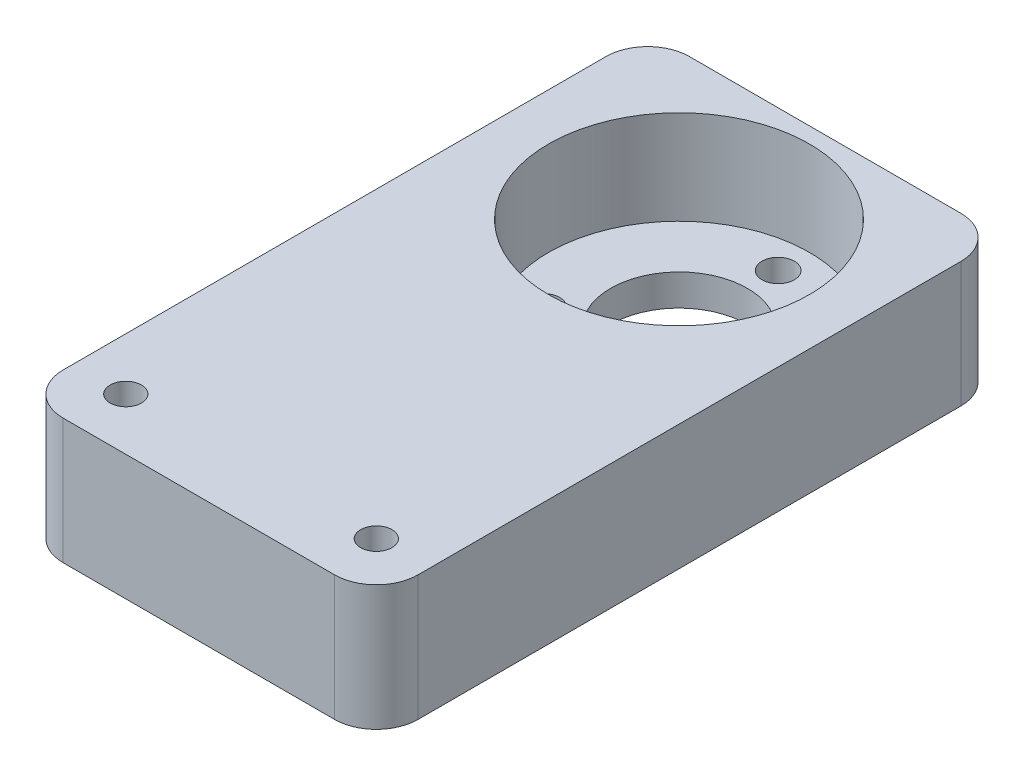
ISO-10303-21;
HEADER;
FILE_DESCRIPTION(('STEP AP214'),'2;1');
FILE_NAME('part.step','',(''),(''),'','','');
FILE_SCHEMA(('AUTOMOTIVE_DESIGN { 1 0 10303 214 1 1 1 1 }'));
ENDSEC;
DATA;
#1=APPLICATION_CONTEXT('core data for automotive mechanical design processes');
#2=APPLICATION_PROTOCOL_DEFINITION('international standard','automotive_design',2000,#1);
#3=PRODUCT_CONTEXT('',#1,'mechanical');
#4=PRODUCT('Part','Part','',(#3));
#5=PRODUCT_RELATED_PRODUCT_CATEGORY('part','',(#4));
#6=PRODUCT_DEFINITION_FORMATION('','',#4);
#7=PRODUCT_DEFINITION_CONTEXT('part definition',#1,'design');
#8=PRODUCT_DEFINITION('design','',#6,#7);
#9=PRODUCT_DEFINITION_SHAPE('','',#8);
#10=(LENGTH_UNIT() NAMED_UNIT(*) SI_UNIT(.MILLI.,.METRE.));
#11=(NAMED_UNIT(*) PLANE_ANGLE_UNIT() SI_UNIT($,.RADIAN.));
#12=(NAMED_UNIT(*) SI_UNIT($,.STERADIAN.) SOLID_ANGLE_UNIT());
#13=UNCERTAINTY_MEASURE_WITH_UNIT(LENGTH_MEASURE(1.E-05),#10,'distance_accuracy_value','');
#14=(GEOMETRIC_REPRESENTATION_CONTEXT(3) GLOBAL_UNCERTAINTY_ASSIGNED_CONTEXT((#13)) GLOBAL_UNIT_ASSIGNED_CONTEXT((#10,
#11,#12)) REPRESENTATION_CONTEXT('',''));
#15=CARTESIAN_POINT('',(0.,0.,0.));
#16=DIRECTION('',(0.,0.,1.));
#17=DIRECTION('',(1.,0.,0.));
#18=AXIS2_PLACEMENT_3D('',#15,#16,#17);
#19=CARTESIAN_POINT('',(17.,12.,30.));
#20=DIRECTION('',(-1.,0.,0.));
#21=DIRECTION('',(0.,0.,1.));
#22=AXIS2_PLACEMENT_3D('',#19,#20,#21);
#23=PLANE('',#22);
#24=DIRECTION('',(0.,0.,-1.));
#25=VECTOR('',#24,1.);
#26=CARTESIAN_POINT('',(17.,12.,30.));
#27=LINE('',#26,#25);
#28=CARTESIAN_POINT('',(17.,12.,26.));
#29=VERTEX_POINT('',#28);
#30=CARTESIAN_POINT('',(17.,12.,-26.));
#31=VERTEX_POINT('',#30);
#32=EDGE_CURVE('E121',#29,#31,#27,.T.);
#33=ORIENTED_EDGE('',*,*,#32,.F.);
#34=DIRECTION('',(0.,-1.,0.));
#35=VECTOR('',#34,1.);
#36=CARTESIAN_POINT('',(17.,12.,26.));
#37=LINE('',#36,#35);
#38=CARTESIAN_POINT('',(17.,0.,26.));
#39=VERTEX_POINT('',#38);
#40=EDGE_CURVE('E106',#29,#39,#37,.T.);
#41=ORIENTED_EDGE('',*,*,#40,.T.);
#42=DIRECTION('',(0.,0.,-1.));
#43=VECTOR('',#42,1.);
#44=CARTESIAN_POINT('',(17.,0.,30.));
#45=LINE('',#44,#43);
#46=CARTESIAN_POINT('',(17.,0.,-26.));
#47=VERTEX_POINT('',#46);
#48=EDGE_CURVE('E118',#39,#47,#45,.T.);
#49=ORIENTED_EDGE('',*,*,#48,.T.);
#50=DIRECTION('',(0.,-1.,0.));
#51=VECTOR('',#50,1.);
#52=CARTESIAN_POINT('',(17.,12.,-26.));
#53=LINE('',#52,#51);
#54=EDGE_CURVE('E123',#47,#31,#53,.F.);
#55=ORIENTED_EDGE('',*,*,#54,.T.);
#56=EDGE_LOOP('',(#33,#41,#49,#55));
#57=FACE_BOUND('',#56,.T.);
#58=ADVANCED_FACE('F35',(#57),#23,.F.);
#59=CARTESIAN_POINT('',(-17.,12.,-30.));
#60=DIRECTION('',(0.,0.,1.));
#61=DIRECTION('',(1.,0.,0.));
#62=AXIS2_PLACEMENT_3D('',#59,#60,#61);
#63=PLANE('',#62);
#64=DIRECTION('',(-1.,0.,0.));
#65=VECTOR('',#64,1.);
#66=CARTESIAN_POINT('',(-17.,12.,-30.));
#67=LINE('',#66,#65);
#68=CARTESIAN_POINT('',(13.,12.,-30.));
#69=VERTEX_POINT('',#68);
#70=CARTESIAN_POINT('',(-13.,12.,-30.));
#71=VERTEX_POINT('',#70);
#72=EDGE_CURVE('E166',#69,#71,#67,.T.);
#73=ORIENTED_EDGE('',*,*,#72,.F.);
#74=DIRECTION('',(0.,-1.,0.));
#75=VECTOR('',#74,1.);
#76=CARTESIAN_POINT('',(13.,12.,-30.));
#77=LINE('',#76,#75);
#78=CARTESIAN_POINT('',(13.,0.,-30.));
#79=VERTEX_POINT('',#78);
#80=EDGE_CURVE('E11',#69,#79,#77,.T.);
#81=ORIENTED_EDGE('',*,*,#80,.T.);
#82=DIRECTION('',(-1.,0.,0.));
#83=VECTOR('',#82,1.);
#84=CARTESIAN_POINT('',(-17.,0.,-30.));
#85=LINE('',#84,#83);
#86=CARTESIAN_POINT('',(-13.,0.,-30.));
#87=VERTEX_POINT('',#86);
#88=EDGE_CURVE('E129',#79,#87,#85,.T.);
#89=ORIENTED_EDGE('',*,*,#88,.T.);
#90=DIRECTION('',(0.,-1.,0.));
#91=VECTOR('',#90,1.);
#92=CARTESIAN_POINT('',(-13.,12.,-30.));
#93=LINE('',#92,#91);
#94=EDGE_CURVE('E43',#87,#71,#93,.F.);
#95=ORIENTED_EDGE('',*,*,#94,.T.);
#96=EDGE_LOOP('',(#73,#81,#89,#95));
#97=FACE_BOUND('',#96,.T.);
#98=ADVANCED_FACE('F165',(#97),#63,.F.);
#99=CARTESIAN_POINT('',(-17.,12.,30.));
#100=DIRECTION('',(1.,0.,0.));
#101=DIRECTION('',(0.,0.,-1.));
#102=AXIS2_PLACEMENT_3D('',#99,#100,#101);
#103=PLANE('',#102);
#104=DIRECTION('',(0.,0.,1.));
#105=VECTOR('',#104,1.);
#106=CARTESIAN_POINT('',(-17.,0.,30.));
#107=LINE('',#106,#105);
#108=CARTESIAN_POINT('',(-17.,0.,-26.));
#109=VERTEX_POINT('',#108);
#110=CARTESIAN_POINT('',(-17.,0.,26.));
#111=VERTEX_POINT('',#110);
#112=EDGE_CURVE('E133',#109,#111,#107,.T.);
#113=ORIENTED_EDGE('',*,*,#112,.T.);
#114=DIRECTION('',(0.,-1.,0.));
#115=VECTOR('',#114,1.);
#116=CARTESIAN_POINT('',(-17.,12.,26.));
#117=LINE('',#116,#115);
#118=CARTESIAN_POINT('',(-17.,12.,26.));
#119=VERTEX_POINT('',#118);
#120=EDGE_CURVE('E50',#111,#119,#117,.F.);
#121=ORIENTED_EDGE('',*,*,#120,.T.);
#122=DIRECTION('',(0.,0.,1.));
#123=VECTOR('',#122,1.);
#124=CARTESIAN_POINT('',(-17.,12.,30.));
#125=LINE('',#124,#123);
#126=CARTESIAN_POINT('',(-17.,12.,-26.));
#127=VERTEX_POINT('',#126);
#128=EDGE_CURVE('E173',#127,#119,#125,.T.);
#129=ORIENTED_EDGE('',*,*,#128,.F.);
#130=DIRECTION('',(0.,-1.,0.));
#131=VECTOR('',#130,1.);
#132=CARTESIAN_POINT('',(-17.,12.,-26.));
#133=LINE('',#132,#131);
#134=EDGE_CURVE('E159',#127,#109,#133,.T.);
#135=ORIENTED_EDGE('',*,*,#134,.T.);
#136=EDGE_LOOP('',(#113,#121,#129,#135));
#137=FACE_BOUND('',#136,.T.);
#138=ADVANCED_FACE('F177',(#137),#103,.F.);
#139=CARTESIAN_POINT('',(-17.,12.,30.));
#140=DIRECTION('',(0.,0.,-1.));
#141=DIRECTION('',(-1.,0.,0.));
#142=AXIS2_PLACEMENT_3D('',#139,#140,#141);
#143=PLANE('',#142);
#144=DIRECTION('',(1.,0.,0.));
#145=VECTOR('',#144,1.);
#146=CARTESIAN_POINT('',(-17.,0.,30.));
#147=LINE('',#146,#145);
#148=CARTESIAN_POINT('',(-13.,0.,30.));
#149=VERTEX_POINT('',#148);
#150=CARTESIAN_POINT('',(13.,0.,30.));
#151=VERTEX_POINT('',#150);
#152=EDGE_CURVE('E143',#149,#151,#147,.T.);
#153=ORIENTED_EDGE('',*,*,#152,.T.);
#154=DIRECTION('',(0.,-1.,0.));
#155=VECTOR('',#154,1.);
#156=CARTESIAN_POINT('',(13.,12.,30.));
#157=LINE('',#156,#155);
#158=CARTESIAN_POINT('',(13.,12.,30.));
#159=VERTEX_POINT('',#158);
#160=EDGE_CURVE('E107',#151,#159,#157,.F.);
#161=ORIENTED_EDGE('',*,*,#160,.T.);
#162=DIRECTION('',(1.,0.,0.));
#163=VECTOR('',#162,1.);
#164=CARTESIAN_POINT('',(-17.,12.,30.));
#165=LINE('',#164,#163);
#166=CARTESIAN_POINT('',(-13.,12.,30.));
#167=VERTEX_POINT('',#166);
#168=EDGE_CURVE('E139',#167,#159,#165,.T.);
#169=ORIENTED_EDGE('',*,*,#168,.F.);
#170=DIRECTION('',(0.,-1.,0.));
#171=VECTOR('',#170,1.);
#172=CARTESIAN_POINT('',(-13.,12.,30.));
#173=LINE('',#172,#171);
#174=EDGE_CURVE('E112',#167,#149,#173,.T.);
#175=ORIENTED_EDGE('',*,*,#174,.T.);
#176=EDGE_LOOP('',(#153,#161,#169,#175));
#177=FACE_BOUND('',#176,.T.);
#178=ADVANCED_FACE('F184',(#177),#143,.F.);
#179=CARTESIAN_POINT('',(0.,12.,0.));
#180=DIRECTION('',(0.,-1.,0.));
#181=DIRECTION('',(0.,0.,-1.));
#182=AXIS2_PLACEMENT_3D('',#179,#180,#181);
#183=PLANE('',#182);
#184=CARTESIAN_POINT('',(0.,12.,-16.));
#185=DIRECTION('',(0.,1.,0.));
#186=DIRECTION('',(0.,0.,1.));
#187=AXIS2_PLACEMENT_3D('',#184,#185,#186);
#188=CIRCLE('',#187,12.5);
#189=CARTESIAN_POINT('',(0.,12.,-3.5));
#190=VERTEX_POINT('',#189);
#191=EDGE_CURVE('E136',#190,#190,#188,.T.);
#192=ORIENTED_EDGE('',*,*,#191,.F.);
#193=EDGE_LOOP('',(#192));
#194=FACE_BOUND('',#193,.T.);
#195=ORIENTED_EDGE('',*,*,#168,.T.);
#196=CARTESIAN_POINT('',(13.,12.,26.));
#197=DIRECTION('',(0.,-1.,0.));
#198=DIRECTION('',(0.,0.,-1.));
#199=AXIS2_PLACEMENT_3D('',#196,#197,#198);
#200=CIRCLE('',#199,4.);
#201=EDGE_CURVE('E157',#159,#29,#200,.F.);
#202=ORIENTED_EDGE('',*,*,#201,.T.);
#203=ORIENTED_EDGE('',*,*,#32,.T.);
#204=CARTESIAN_POINT('',(13.,12.,-26.));
#205=DIRECTION('',(0.,-1.,0.));
#206=DIRECTION('',(0.,0.,-1.));
#207=AXIS2_PLACEMENT_3D('',#204,#205,#206);
#208=CIRCLE('',#207,4.);
#209=EDGE_CURVE('E153',#31,#69,#208,.F.);
#210=ORIENTED_EDGE('',*,*,#209,.T.);
#211=ORIENTED_EDGE('',*,*,#72,.T.);
#212=CARTESIAN_POINT('',(-13.,12.,-26.));
#213=DIRECTION('',(0.,-1.,0.));
#214=DIRECTION('',(0.,0.,-1.));
#215=AXIS2_PLACEMENT_3D('',#212,#213,#214);
#216=CIRCLE('',#215,4.);
#217=EDGE_CURVE('E57',#71,#127,#216,.F.);
#218=ORIENTED_EDGE('',*,*,#217,.T.);
#219=ORIENTED_EDGE('',*,*,#128,.T.);
#220=CARTESIAN_POINT('',(-13.,12.,26.));
#221=DIRECTION('',(0.,-1.,0.));
#222=DIRECTION('',(0.,0.,-1.));
#223=AXIS2_PLACEMENT_3D('',#220,#221,#222);
#224=CIRCLE('',#223,4.);
#225=EDGE_CURVE('E155',#119,#167,#224,.F.);
#226=ORIENTED_EDGE('',*,*,#225,.T.);
#227=EDGE_LOOP('',(#195,#202,#203,#210,#211,#218,#219,#226));
#228=FACE_BOUND('',#227,.T.);
#229=CARTESIAN_POINT('',(-12.,12.,25.));
#230=DIRECTION('',(0.,1.,0.));
#231=DIRECTION('',(0.,0.,1.));
#232=AXIS2_PLACEMENT_3D('',#229,#230,#231);
#233=CIRCLE('',#232,1.5);
#234=CARTESIAN_POINT('',(-12.,12.,26.5));
#235=VERTEX_POINT('',#234);
#236=EDGE_CURVE('E216',#235,#235,#233,.T.);
#237=ORIENTED_EDGE('',*,*,#236,.F.);
#238=EDGE_LOOP('',(#237));
#239=FACE_BOUND('',#238,.T.);
#240=CARTESIAN_POINT('',(12.,12.,25.));
#241=DIRECTION('',(0.,1.,0.));
#242=DIRECTION('',(0.,0.,1.));
#243=AXIS2_PLACEMENT_3D('',#240,#241,#242);
#244=CIRCLE('',#243,1.5);
#245=CARTESIAN_POINT('',(12.,12.,26.5));
#246=VERTEX_POINT('',#245);
#247=EDGE_CURVE('E222',#246,#246,#244,.T.);
#248=ORIENTED_EDGE('',*,*,#247,.F.);
#249=EDGE_LOOP('',(#248));
#250=FACE_BOUND('',#249,.T.);
#251=ADVANCED_FACE('F170',(#194,#228,#239,#250),#183,.F.);
#252=CARTESIAN_POINT('',(0.,0.,0.));
#253=DIRECTION('',(0.,-1.,0.));
#254=DIRECTION('',(0.,0.,-1.));
#255=AXIS2_PLACEMENT_3D('',#252,#253,#254);
#256=PLANE('',#255);
#257=CARTESIAN_POINT('',(0.,0.,-25.5));
#258=DIRECTION('',(0.,1.,0.));
#259=DIRECTION('',(0.,0.,1.));
#260=AXIS2_PLACEMENT_3D('',#257,#258,#259);
#261=CIRCLE('',#260,1.55);
#262=CARTESIAN_POINT('',(0.,0.,-23.95));
#263=VERTEX_POINT('',#262);
#264=EDGE_CURVE('E193',#263,#263,#261,.T.);
#265=ORIENTED_EDGE('',*,*,#264,.T.);
#266=EDGE_LOOP('',(#265));
#267=FACE_BOUND('',#266,.T.);
#268=CARTESIAN_POINT('',(8.22724133595217,0.,-11.25));
#269=DIRECTION('',(0.,1.,0.));
#270=DIRECTION('',(0.,0.,1.));
#271=AXIS2_PLACEMENT_3D('',#268,#269,#270);
#272=CIRCLE('',#271,1.54999999999973);
#273=CARTESIAN_POINT('',(8.22724133595217,0.,-9.70000000000027));
#274=VERTEX_POINT('',#273);
#275=EDGE_CURVE('E206',#274,#274,#272,.T.);
#276=ORIENTED_EDGE('',*,*,#275,.T.);
#277=EDGE_LOOP('',(#276));
#278=FACE_BOUND('',#277,.T.);
#279=CARTESIAN_POINT('',(-8.22724133595217,0.,-11.25));
#280=DIRECTION('',(0.,1.,0.));
#281=DIRECTION('',(0.,0.,1.));
#282=AXIS2_PLACEMENT_3D('',#279,#280,#281);
#283=CIRCLE('',#282,1.54999999999963);
#284=CARTESIAN_POINT('',(-8.22724133595217,0.,-9.70000000000036));
#285=VERTEX_POINT('',#284);
#286=EDGE_CURVE('E199',#285,#285,#283,.T.);
#287=ORIENTED_EDGE('',*,*,#286,.T.);
#288=EDGE_LOOP('',(#287));
#289=FACE_BOUND('',#288,.T.);
#290=CARTESIAN_POINT('',(0.,0.,-16.));
#291=DIRECTION('',(0.,1.,0.));
#292=DIRECTION('',(0.,0.,1.));
#293=AXIS2_PLACEMENT_3D('',#290,#291,#292);
#294=CIRCLE('',#293,6.55);
#295=CARTESIAN_POINT('',(0.,0.,-9.45));
#296=VERTEX_POINT('',#295);
#297=EDGE_CURVE('E188',#296,#296,#294,.T.);
#298=ORIENTED_EDGE('',*,*,#297,.T.);
#299=EDGE_LOOP('',(#298));
#300=FACE_BOUND('',#299,.T.);
#301=ORIENTED_EDGE('',*,*,#48,.F.);
#302=CARTESIAN_POINT('',(13.,0.,26.));
#303=DIRECTION('',(0.,-1.,0.));
#304=DIRECTION('',(0.,0.,-1.));
#305=AXIS2_PLACEMENT_3D('',#302,#303,#304);
#306=CIRCLE('',#305,4.);
#307=EDGE_CURVE('E102',#39,#151,#306,.T.);
#308=ORIENTED_EDGE('',*,*,#307,.T.);
#309=ORIENTED_EDGE('',*,*,#152,.F.);
#310=CARTESIAN_POINT('',(-13.,0.,26.));
#311=DIRECTION('',(0.,-1.,0.));
#312=DIRECTION('',(0.,0.,-1.));
#313=AXIS2_PLACEMENT_3D('',#310,#311,#312);
#314=CIRCLE('',#313,4.);
#315=EDGE_CURVE('E113',#149,#111,#314,.T.);
#316=ORIENTED_EDGE('',*,*,#315,.T.);
#317=ORIENTED_EDGE('',*,*,#112,.F.);
#318=CARTESIAN_POINT('',(-13.,0.,-26.));
#319=DIRECTION('',(0.,-1.,0.));
#320=DIRECTION('',(0.,0.,-1.));
#321=AXIS2_PLACEMENT_3D('',#318,#319,#320);
#322=CIRCLE('',#321,4.);
#323=EDGE_CURVE('E122',#109,#87,#322,.T.);
#324=ORIENTED_EDGE('',*,*,#323,.T.);
#325=ORIENTED_EDGE('',*,*,#88,.F.);
#326=CARTESIAN_POINT('',(13.,0.,-26.));
#327=DIRECTION('',(0.,-1.,0.));
#328=DIRECTION('',(0.,0.,-1.));
#329=AXIS2_PLACEMENT_3D('',#326,#327,#328);
#330=CIRCLE('',#329,4.);
#331=EDGE_CURVE('E128',#79,#47,#330,.T.);
#332=ORIENTED_EDGE('',*,*,#331,.T.);
#333=EDGE_LOOP('',(#301,#308,#309,#316,#317,#324,#325,#332));
#334=FACE_BOUND('',#333,.T.);
#335=CARTESIAN_POINT('',(-12.,0.,25.));
#336=DIRECTION('',(0.,-1.,0.));
#337=DIRECTION('',(0.,0.,-1.));
#338=AXIS2_PLACEMENT_3D('',#335,#336,#337);
#339=CIRCLE('',#338,1.5);
#340=CARTESIAN_POINT('',(-12.,0.,23.5));
#341=VERTEX_POINT('',#340);
#342=EDGE_CURVE('E200',#341,#341,#339,.F.);
#343=ORIENTED_EDGE('',*,*,#342,.T.);
#344=EDGE_LOOP('',(#343));
#345=FACE_BOUND('',#344,.T.);
#346=CARTESIAN_POINT('',(12.,0.,25.));
#347=DIRECTION('',(0.,-1.,0.));
#348=DIRECTION('',(0.,0.,-1.));
#349=AXIS2_PLACEMENT_3D('',#346,#347,#348);
#350=CIRCLE('',#349,1.5);
#351=CARTESIAN_POINT('',(12.,0.,23.5));
#352=VERTEX_POINT('',#351);
#353=EDGE_CURVE('E219',#352,#352,#350,.F.);
#354=ORIENTED_EDGE('',*,*,#353,.T.);
#355=EDGE_LOOP('',(#354));
#356=FACE_BOUND('',#355,.T.);
#357=ADVANCED_FACE('F125',(#267,#278,#289,#300,#334,#345,#356),#256,.T.);
#358=CARTESIAN_POINT('',(0.,3.,-16.));
#359=DIRECTION('',(0.,1.,0.));
#360=DIRECTION('',(0.,0.,1.));
#361=AXIS2_PLACEMENT_3D('',#358,#359,#360);
#362=CYLINDRICAL_SURFACE('',#361,12.5);
#363=CARTESIAN_POINT('',(0.,3.,-16.));
#364=DIRECTION('',(0.,1.,0.));
#365=DIRECTION('',(0.,0.,1.));
#366=AXIS2_PLACEMENT_3D('',#363,#364,#365);
#367=CIRCLE('',#366,12.5);
#368=CARTESIAN_POINT('',(0.,3.,-3.5));
#369=VERTEX_POINT('',#368);
#370=EDGE_CURVE('E130',#369,#369,#367,.T.);
#371=ORIENTED_EDGE('',*,*,#370,.F.);
#372=EDGE_LOOP('',(#371));
#373=FACE_BOUND('',#372,.T.);
#374=ORIENTED_EDGE('',*,*,#191,.T.);
#375=EDGE_LOOP('',(#374));
#376=FACE_BOUND('',#375,.T.);
#377=ADVANCED_FACE('F236',(#373,#376),#362,.F.);
#378=CARTESIAN_POINT('',(0.,3.,-16.));
#379=DIRECTION('',(0.,1.,0.));
#380=DIRECTION('',(0.,0.,1.));
#381=AXIS2_PLACEMENT_3D('',#378,#379,#380);
#382=PLANE('',#381);
#383=CARTESIAN_POINT('',(0.,3.,-25.5));
#384=DIRECTION('',(0.,1.,0.));
#385=DIRECTION('',(0.,0.,1.));
#386=AXIS2_PLACEMENT_3D('',#383,#384,#385);
#387=CIRCLE('',#386,1.55);
#388=CARTESIAN_POINT('',(0.,3.,-23.95));
#389=VERTEX_POINT('',#388);
#390=EDGE_CURVE('E209',#389,#389,#387,.T.);
#391=ORIENTED_EDGE('',*,*,#390,.F.);
#392=EDGE_LOOP('',(#391));
#393=FACE_BOUND('',#392,.T.);
#394=CARTESIAN_POINT('',(8.22724133595217,3.,-11.25));
#395=DIRECTION('',(0.,1.,0.));
#396=DIRECTION('',(0.,0.,1.));
#397=AXIS2_PLACEMENT_3D('',#394,#395,#396);
#398=CIRCLE('',#397,1.54999999999973);
#399=CARTESIAN_POINT('',(8.22724133595217,3.,-9.70000000000027));
#400=VERTEX_POINT('',#399);
#401=EDGE_CURVE('E203',#400,#400,#398,.T.);
#402=ORIENTED_EDGE('',*,*,#401,.F.);
#403=EDGE_LOOP('',(#402));
#404=FACE_BOUND('',#403,.T.);
#405=CARTESIAN_POINT('',(-8.22724133595217,3.,-11.25));
#406=DIRECTION('',(0.,1.,0.));
#407=DIRECTION('',(0.,0.,1.));
#408=AXIS2_PLACEMENT_3D('',#405,#406,#407);
#409=CIRCLE('',#408,1.54999999999963);
#410=CARTESIAN_POINT('',(-8.22724133595217,3.,-9.70000000000036));
#411=VERTEX_POINT('',#410);
#412=EDGE_CURVE('E196',#411,#411,#409,.T.);
#413=ORIENTED_EDGE('',*,*,#412,.F.);
#414=EDGE_LOOP('',(#413));
#415=FACE_BOUND('',#414,.T.);
#416=CARTESIAN_POINT('',(0.,3.,-16.));
#417=DIRECTION('',(0.,1.,0.));
#418=DIRECTION('',(0.,0.,1.));
#419=AXIS2_PLACEMENT_3D('',#416,#417,#418);
#420=CIRCLE('',#419,6.55);
#421=CARTESIAN_POINT('',(0.,3.,-9.45));
#422=VERTEX_POINT('',#421);
#423=EDGE_CURVE('E190',#422,#422,#420,.T.);
#424=ORIENTED_EDGE('',*,*,#423,.F.);
#425=EDGE_LOOP('',(#424));
#426=FACE_BOUND('',#425,.T.);
#427=ORIENTED_EDGE('',*,*,#370,.T.);
#428=EDGE_LOOP('',(#427));
#429=FACE_BOUND('',#428,.T.);
#430=ADVANCED_FACE('F286',(#393,#404,#415,#426,#429),#382,.T.);
#431=CARTESIAN_POINT('',(0.,0.,-16.));
#432=DIRECTION('',(0.,1.,0.));
#433=DIRECTION('',(0.,0.,1.));
#434=AXIS2_PLACEMENT_3D('',#431,#432,#433);
#435=CYLINDRICAL_SURFACE('',#434,6.55);
#436=ORIENTED_EDGE('',*,*,#297,.F.);
#437=EDGE_LOOP('',(#436));
#438=FACE_BOUND('',#437,.T.);
#439=ORIENTED_EDGE('',*,*,#423,.T.);
#440=EDGE_LOOP('',(#439));
#441=FACE_BOUND('',#440,.T.);
#442=ADVANCED_FACE('F282',(#438,#441),#435,.F.);
#443=CARTESIAN_POINT('',(-8.22724133595217,0.,-11.25));
#444=DIRECTION('',(0.,1.,0.));
#445=DIRECTION('',(0.,0.,1.));
#446=AXIS2_PLACEMENT_3D('',#443,#444,#445);
#447=CYLINDRICAL_SURFACE('',#446,1.54999999999963);
#448=ORIENTED_EDGE('',*,*,#286,.F.);
#449=EDGE_LOOP('',(#448));
#450=FACE_BOUND('',#449,.T.);
#451=ORIENTED_EDGE('',*,*,#412,.T.);
#452=EDGE_LOOP('',(#451));
#453=FACE_BOUND('',#452,.T.);
#454=ADVANCED_FACE('F278',(#450,#453),#447,.F.);
#455=CARTESIAN_POINT('',(8.22724133595217,0.,-11.25));
#456=DIRECTION('',(0.,1.,0.));
#457=DIRECTION('',(0.,0.,1.));
#458=AXIS2_PLACEMENT_3D('',#455,#456,#457);
#459=CYLINDRICAL_SURFACE('',#458,1.54999999999973);
#460=ORIENTED_EDGE('',*,*,#275,.F.);
#461=EDGE_LOOP('',(#460));
#462=FACE_BOUND('',#461,.T.);
#463=ORIENTED_EDGE('',*,*,#401,.T.);
#464=EDGE_LOOP('',(#463));
#465=FACE_BOUND('',#464,.T.);
#466=ADVANCED_FACE('F274',(#462,#465),#459,.F.);
#467=CARTESIAN_POINT('',(0.,0.,-25.5));
#468=DIRECTION('',(0.,1.,0.));
#469=DIRECTION('',(0.,0.,1.));
#470=AXIS2_PLACEMENT_3D('',#467,#468,#469);
#471=CYLINDRICAL_SURFACE('',#470,1.55);
#472=ORIENTED_EDGE('',*,*,#264,.F.);
#473=EDGE_LOOP('',(#472));
#474=FACE_BOUND('',#473,.T.);
#475=ORIENTED_EDGE('',*,*,#390,.T.);
#476=EDGE_LOOP('',(#475));
#477=FACE_BOUND('',#476,.T.);
#478=ADVANCED_FACE('F253',(#474,#477),#471,.F.);
#479=CARTESIAN_POINT('',(13.,12.,26.));
#480=DIRECTION('',(0.,-1.,0.));
#481=DIRECTION('',(0.,0.,-1.));
#482=AXIS2_PLACEMENT_3D('',#479,#480,#481);
#483=CYLINDRICAL_SURFACE('',#482,4.);
#484=ORIENTED_EDGE('',*,*,#201,.F.);
#485=ORIENTED_EDGE('',*,*,#160,.F.);
#486=ORIENTED_EDGE('',*,*,#307,.F.);
#487=ORIENTED_EDGE('',*,*,#40,.F.);
#488=EDGE_LOOP('',(#484,#485,#486,#487));
#489=FACE_BOUND('',#488,.T.);
#490=ADVANCED_FACE('F105',(#489),#483,.T.);
#491=CARTESIAN_POINT('',(-13.,12.,26.));
#492=DIRECTION('',(0.,-1.,0.));
#493=DIRECTION('',(0.,0.,-1.));
#494=AXIS2_PLACEMENT_3D('',#491,#492,#493);
#495=CYLINDRICAL_SURFACE('',#494,4.);
#496=ORIENTED_EDGE('',*,*,#225,.F.);
#497=ORIENTED_EDGE('',*,*,#120,.F.);
#498=ORIENTED_EDGE('',*,*,#315,.F.);
#499=ORIENTED_EDGE('',*,*,#174,.F.);
#500=EDGE_LOOP('',(#496,#497,#498,#499));
#501=FACE_BOUND('',#500,.T.);
#502=ADVANCED_FACE('F181',(#501),#495,.T.);
#503=CARTESIAN_POINT('',(13.,12.,-26.));
#504=DIRECTION('',(0.,-1.,0.));
#505=DIRECTION('',(0.,0.,-1.));
#506=AXIS2_PLACEMENT_3D('',#503,#504,#505);
#507=CYLINDRICAL_SURFACE('',#506,4.);
#508=ORIENTED_EDGE('',*,*,#209,.F.);
#509=ORIENTED_EDGE('',*,*,#54,.F.);
#510=ORIENTED_EDGE('',*,*,#331,.F.);
#511=ORIENTED_EDGE('',*,*,#80,.F.);
#512=EDGE_LOOP('',(#508,#509,#510,#511));
#513=FACE_BOUND('',#512,.T.);
#514=ADVANCED_FACE('F255',(#513),#507,.T.);
#515=CARTESIAN_POINT('',(-13.,12.,-26.));
#516=DIRECTION('',(0.,-1.,0.));
#517=DIRECTION('',(0.,0.,-1.));
#518=AXIS2_PLACEMENT_3D('',#515,#516,#517);
#519=CYLINDRICAL_SURFACE('',#518,4.);
#520=ORIENTED_EDGE('',*,*,#217,.F.);
#521=ORIENTED_EDGE('',*,*,#94,.F.);
#522=ORIENTED_EDGE('',*,*,#323,.F.);
#523=ORIENTED_EDGE('',*,*,#134,.F.);
#524=EDGE_LOOP('',(#520,#521,#522,#523));
#525=FACE_BOUND('',#524,.T.);
#526=ADVANCED_FACE('F37',(#525),#519,.T.);
#527=CARTESIAN_POINT('',(-12.,-5.939696961967,25.));
#528=DIRECTION('',(0.,1.,0.));
#529=DIRECTION('',(0.,0.,1.));
#530=AXIS2_PLACEMENT_3D('',#527,#528,#529);
#531=CYLINDRICAL_SURFACE('',#530,1.5);
#532=ORIENTED_EDGE('',*,*,#236,.T.);
#533=EDGE_LOOP('',(#532));
#534=FACE_BOUND('',#533,.T.);
#535=ORIENTED_EDGE('',*,*,#342,.F.);
#536=EDGE_LOOP('',(#535));
#537=FACE_BOUND('',#536,.T.);
#538=ADVANCED_FACE('F260',(#534,#537),#531,.F.);
#539=CARTESIAN_POINT('',(12.,-5.939696961967,25.));
#540=DIRECTION('',(0.,1.,0.));
#541=DIRECTION('',(0.,0.,1.));
#542=AXIS2_PLACEMENT_3D('',#539,#540,#541);
#543=CYLINDRICAL_SURFACE('',#542,1.5);
#544=ORIENTED_EDGE('',*,*,#247,.T.);
#545=EDGE_LOOP('',(#544));
#546=FACE_BOUND('',#545,.T.);
#547=ORIENTED_EDGE('',*,*,#353,.F.);
#548=EDGE_LOOP('',(#547));
#549=FACE_BOUND('',#548,.T.);
#550=ADVANCED_FACE('F226',(#546,#549),#543,.F.);
#551=CLOSED_SHELL('',(#58,#98,#138,#178,#251,#357,#377,#430,#442,#454,#466,#478,#490,#502,#514,
#526,#538,#550));
#552=MANIFOLD_SOLID_BREP('B2',#551);
#553=ADVANCED_BREP_SHAPE_REPRESENTATION('',(#18,#552),#14);
#554=SHAPE_DEFINITION_REPRESENTATION(#9,#553);
ENDSEC;
END-ISO-10303-21;
